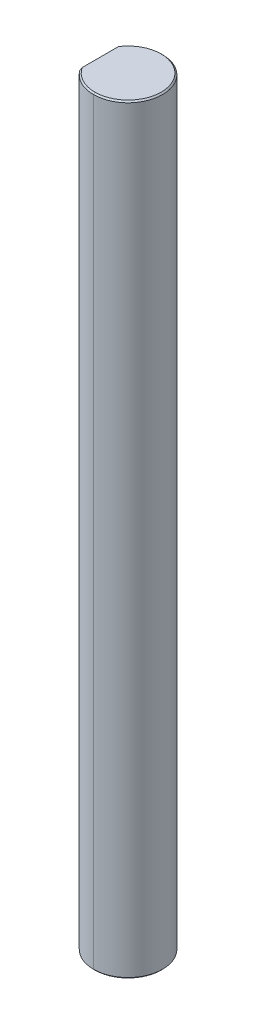
ISO-10303-21;
HEADER;
FILE_DESCRIPTION(('STEP AP214'),'2;1');
FILE_NAME('part.step','',(''),(''),'','','');
FILE_SCHEMA(('AUTOMOTIVE_DESIGN { 1 0 10303 214 1 1 1 1 }'));
ENDSEC;
DATA;
#1=APPLICATION_CONTEXT('core data for automotive mechanical design processes');
#2=APPLICATION_PROTOCOL_DEFINITION('international standard','automotive_design',2000,#1);
#3=PRODUCT_CONTEXT('',#1,'mechanical');
#4=PRODUCT('Part','Part','',(#3));
#5=PRODUCT_RELATED_PRODUCT_CATEGORY('part','',(#4));
#6=PRODUCT_DEFINITION_FORMATION('','',#4);
#7=PRODUCT_DEFINITION_CONTEXT('part definition',#1,'design');
#8=PRODUCT_DEFINITION('design','',#6,#7);
#9=PRODUCT_DEFINITION_SHAPE('','',#8);
#10=(LENGTH_UNIT() NAMED_UNIT(*) SI_UNIT(.MILLI.,.METRE.));
#11=(NAMED_UNIT(*) PLANE_ANGLE_UNIT() SI_UNIT($,.RADIAN.));
#12=(NAMED_UNIT(*) SI_UNIT($,.STERADIAN.) SOLID_ANGLE_UNIT());
#13=UNCERTAINTY_MEASURE_WITH_UNIT(LENGTH_MEASURE(1.E-05),#10,'distance_accuracy_value','');
#14=(GEOMETRIC_REPRESENTATION_CONTEXT(3) GLOBAL_UNCERTAINTY_ASSIGNED_CONTEXT((#13)) GLOBAL_UNIT_ASSIGNED_CONTEXT((#10,
#11,#12)) REPRESENTATION_CONTEXT('',''));
#15=CARTESIAN_POINT('',(0.,0.,0.));
#16=DIRECTION('',(0.,0.,1.));
#17=DIRECTION('',(1.,0.,0.));
#18=AXIS2_PLACEMENT_3D('',#15,#16,#17);
#19=CARTESIAN_POINT('',(0.,69.85,0.));
#20=DIRECTION('',(0.,-1.,0.));
#21=DIRECTION('',(0.,0.,-1.));
#22=AXIS2_PLACEMENT_3D('',#19,#20,#21);
#23=CONICAL_SURFACE('',#22,3.04419,0.785398163397457);
#24=DIRECTION('',(0.,-0.707106781186542,0.707106781186554));
#25=VECTOR('',#24,1.);
#26=CARTESIAN_POINT('',(0.,69.85,3.04419));
#27=LINE('',#26,#25);
#28=CARTESIAN_POINT('',(0.,69.85,3.04419));
#29=VERTEX_POINT('',#28);
#30=CARTESIAN_POINT('',(0.,69.723,3.17119));
#31=VERTEX_POINT('',#30);
#32=EDGE_CURVE('E97',#29,#31,#27,.T.);
#33=ORIENTED_EDGE('',*,*,#32,.F.);
#34=CARTESIAN_POINT('',(0.,69.85,0.));
#35=DIRECTION('',(0.,1.,0.));
#36=DIRECTION('',(0.,0.,1.));
#37=AXIS2_PLACEMENT_3D('',#34,#35,#36);
#38=CIRCLE('',#37,3.04419);
#39=CARTESIAN_POINT('',(-2.54381,69.85,1.67216130800831));
#40=VERTEX_POINT('',#39);
#41=EDGE_CURVE('E29',#40,#29,#38,.T.);
#42=ORIENTED_EDGE('',*,*,#41,.F.);
#43=CARTESIAN_POINT('',(-2.54381,69.723,1.89353550270387));
#44=CARTESIAN_POINT('',(-2.54381,69.7666137464441,1.82049357854221));
#45=CARTESIAN_POINT('',(-2.54381,69.809042414268,1.74672509100733));
#46=CARTESIAN_POINT('',(-2.54381,69.85,1.67216130800831));
#47=(BOUNDED_CURVE() B_SPLINE_CURVE(3,(#43,#44,#45,#46),.UNSPECIFIED.,.F.,
.F.) B_SPLINE_CURVE_WITH_KNOTS((4,4),(0.,0.00025521664145801),
.UNSPECIFIED.) CURVE() GEOMETRIC_REPRESENTATION_ITEM() RATIONAL_B_SPLINE_CURVE((1.,1.,1.,1.)) REPRESENTATION_ITEM(''));
#48=CARTESIAN_POINT('',(-2.54381,69.723,1.89353550270387));
#49=VERTEX_POINT('',#48);
#50=EDGE_CURVE('E100',#49,#40,#47,.T.);
#51=ORIENTED_EDGE('',*,*,#50,.F.);
#52=CARTESIAN_POINT('',(0.,69.723,0.));
#53=DIRECTION('',(0.,-1.,0.));
#54=DIRECTION('',(0.,0.,1.));
#55=AXIS2_PLACEMENT_3D('',#52,#53,#54);
#56=CIRCLE('',#55,3.17119);
#57=EDGE_CURVE('E94',#31,#49,#56,.T.);
#58=ORIENTED_EDGE('',*,*,#57,.F.);
#59=EDGE_LOOP('',(#33,#42,#51,#58));
#60=FACE_BOUND('',#59,.T.);
#61=ADVANCED_FACE('F16',(#60),#23,.T.);
#62=CARTESIAN_POINT('',(0.,0.127000000000016,0.));
#63=DIRECTION('',(0.,1.,0.));
#64=DIRECTION('',(0.,0.,1.));
#65=AXIS2_PLACEMENT_3D('',#62,#63,#64);
#66=CONICAL_SURFACE('',#65,3.17119,0.785398163397429);
#67=DIRECTION('',(0.,0.707106781186561,-0.707106781186534));
#68=VECTOR('',#67,1.);
#69=CARTESIAN_POINT('',(0.,0.127000000000016,-3.17119));
#70=LINE('',#69,#68);
#71=CARTESIAN_POINT('',(0.,0.,-3.04419));
#72=VERTEX_POINT('',#71);
#73=CARTESIAN_POINT('',(0.,0.127000000000016,-3.17119));
#74=VERTEX_POINT('',#73);
#75=EDGE_CURVE('E158',#72,#74,#70,.T.);
#76=ORIENTED_EDGE('',*,*,#75,.F.);
#77=CARTESIAN_POINT('',(0.,0.,0.));
#78=DIRECTION('',(0.,-1.,0.));
#79=DIRECTION('',(0.,0.,1.));
#80=AXIS2_PLACEMENT_3D('',#77,#78,#79);
#81=CIRCLE('',#80,3.04419);
#82=CARTESIAN_POINT('',(-2.54381,0.,-1.67216130800827));
#83=VERTEX_POINT('',#82);
#84=EDGE_CURVE('E11',#83,#72,#81,.T.);
#85=ORIENTED_EDGE('',*,*,#84,.F.);
#86=CARTESIAN_POINT('',(-2.54381,0.127000000000016,-1.89353550270387));
#87=CARTESIAN_POINT('',(-2.54381,0.083386253555959,-1.8204935785422));
#88=CARTESIAN_POINT('',(-2.54381,0.0409575857320611,-1.7467250910073));
#89=CARTESIAN_POINT('',(-2.54381,0.,-1.67216130800827));
#90=(BOUNDED_CURVE() B_SPLINE_CURVE(3,(#86,#87,#88,#89),.UNSPECIFIED.,.F.,
.F.) B_SPLINE_CURVE_WITH_KNOTS((4,4),(0.,0.000255216641458055),
.UNSPECIFIED.) CURVE() GEOMETRIC_REPRESENTATION_ITEM() RATIONAL_B_SPLINE_CURVE((1.,1.,1.,1.)) REPRESENTATION_ITEM(''));
#91=CARTESIAN_POINT('',(-2.54381,0.127000000000016,-1.89353550270387));
#92=VERTEX_POINT('',#91);
#93=EDGE_CURVE('E209',#92,#83,#90,.T.);
#94=ORIENTED_EDGE('',*,*,#93,.F.);
#95=CARTESIAN_POINT('',(0.,0.127000000000016,0.));
#96=DIRECTION('',(0.,1.,0.));
#97=DIRECTION('',(0.,0.,1.));
#98=AXIS2_PLACEMENT_3D('',#95,#96,#97);
#99=CIRCLE('',#98,3.17119);
#100=EDGE_CURVE('E161',#74,#92,#99,.T.);
#101=ORIENTED_EDGE('',*,*,#100,.F.);
#102=EDGE_LOOP('',(#76,#85,#94,#101));
#103=FACE_BOUND('',#102,.T.);
#104=ADVANCED_FACE('F263',(#103),#66,.T.);
#105=CARTESIAN_POINT('',(0.,0.,0.));
#106=DIRECTION('',(0.,1.,0.));
#107=DIRECTION('',(1.,0.,0.));
#108=AXIS2_PLACEMENT_3D('',#105,#106,#107);
#109=PLANE('',#108);
#110=DIRECTION('',(0.,0.,1.));
#111=VECTOR('',#110,1.);
#112=CARTESIAN_POINT('',(-2.54381,0.,-1.89353550270387));
#113=LINE('',#112,#111);
#114=CARTESIAN_POINT('',(-2.54381,0.,1.67216130800827));
#115=VERTEX_POINT('',#114);
#116=EDGE_CURVE('E151',#83,#115,#113,.T.);
#117=ORIENTED_EDGE('',*,*,#116,.F.);
#118=ORIENTED_EDGE('',*,*,#84,.T.);
#119=CARTESIAN_POINT('',(0.,0.,0.));
#120=DIRECTION('',(0.,-1.,0.));
#121=DIRECTION('',(0.,0.,1.));
#122=AXIS2_PLACEMENT_3D('',#119,#120,#121);
#123=CIRCLE('',#122,3.04419);
#124=CARTESIAN_POINT('',(0.,0.,3.04419));
#125=VERTEX_POINT('',#124);
#126=EDGE_CURVE('E152',#72,#125,#123,.T.);
#127=ORIENTED_EDGE('',*,*,#126,.T.);
#128=CARTESIAN_POINT('',(0.,0.,0.));
#129=DIRECTION('',(0.,-1.,0.));
#130=DIRECTION('',(0.,0.,1.));
#131=AXIS2_PLACEMENT_3D('',#128,#129,#130);
#132=CIRCLE('',#131,3.04419);
#133=EDGE_CURVE('E210',#125,#115,#132,.T.);
#134=ORIENTED_EDGE('',*,*,#133,.T.);
#135=EDGE_LOOP('',(#117,#118,#127,#134));
#136=FACE_BOUND('',#135,.T.);
#137=ADVANCED_FACE('F250',(#136),#109,.F.);
#138=CARTESIAN_POINT('',(0.,69.85,0.));
#139=DIRECTION('',(0.,1.,0.));
#140=DIRECTION('',(1.,0.,0.));
#141=AXIS2_PLACEMENT_3D('',#138,#139,#140);
#142=PLANE('',#141);
#143=DIRECTION('',(0.,0.,1.));
#144=VECTOR('',#143,1.);
#145=CARTESIAN_POINT('',(-2.54381,69.85,-1.89353550270387));
#146=LINE('',#145,#144);
#147=CARTESIAN_POINT('',(-2.54381,69.85,-1.67216130800831));
#148=VERTEX_POINT('',#147);
#149=EDGE_CURVE('E150',#148,#40,#146,.T.);
#150=ORIENTED_EDGE('',*,*,#149,.T.);
#151=ORIENTED_EDGE('',*,*,#41,.T.);
#152=CARTESIAN_POINT('',(0.,69.85,0.));
#153=DIRECTION('',(0.,1.,0.));
#154=DIRECTION('',(0.,0.,1.));
#155=AXIS2_PLACEMENT_3D('',#152,#153,#154);
#156=CIRCLE('',#155,3.04419);
#157=CARTESIAN_POINT('',(0.,69.85,-3.04419));
#158=VERTEX_POINT('',#157);
#159=EDGE_CURVE('E133',#29,#158,#156,.T.);
#160=ORIENTED_EDGE('',*,*,#159,.T.);
#161=CARTESIAN_POINT('',(0.,69.85,0.));
#162=DIRECTION('',(0.,1.,0.));
#163=DIRECTION('',(0.,0.,1.));
#164=AXIS2_PLACEMENT_3D('',#161,#162,#163);
#165=CIRCLE('',#164,3.04419);
#166=EDGE_CURVE('E145',#158,#148,#165,.T.);
#167=ORIENTED_EDGE('',*,*,#166,.T.);
#168=EDGE_LOOP('',(#150,#151,#160,#167));
#169=FACE_BOUND('',#168,.T.);
#170=ADVANCED_FACE('F235',(#169),#142,.T.);
#171=CARTESIAN_POINT('',(-2.54381,69.85,-1.89353550270387));
#172=DIRECTION('',(1.,0.,0.));
#173=DIRECTION('',(0.,1.,0.));
#174=AXIS2_PLACEMENT_3D('',#171,#172,#173);
#175=PLANE('',#174);
#176=DIRECTION('',(0.,-1.,0.));
#177=VECTOR('',#176,1.);
#178=CARTESIAN_POINT('',(-2.54381,69.85,-1.89353550270387));
#179=LINE('',#178,#177);
#180=CARTESIAN_POINT('',(-2.54381,69.723,-1.89353550270387));
#181=VERTEX_POINT('',#180);
#182=EDGE_CURVE('E105',#181,#92,#179,.T.);
#183=ORIENTED_EDGE('',*,*,#182,.T.);
#184=ORIENTED_EDGE('',*,*,#93,.T.);
#185=ORIENTED_EDGE('',*,*,#116,.T.);
#186=CARTESIAN_POINT('',(-2.54381,0.,1.67216130800827));
#187=CARTESIAN_POINT('',(-2.54381,0.0409575857320672,1.7467250910073));
#188=CARTESIAN_POINT('',(-2.54381,0.0833862535559554,1.8204935785422));
#189=CARTESIAN_POINT('',(-2.54381,0.127000000000016,1.89353550270387));
#190=(BOUNDED_CURVE() B_SPLINE_CURVE(3,(#186,#187,#188,#189),.UNSPECIFIED.,.F.,
.F.) B_SPLINE_CURVE_WITH_KNOTS((4,4),(0.,0.000255216641458055),
.UNSPECIFIED.) CURVE() GEOMETRIC_REPRESENTATION_ITEM() RATIONAL_B_SPLINE_CURVE((1.,1.,1.,1.)) REPRESENTATION_ITEM(''));
#191=CARTESIAN_POINT('',(-2.54381,0.127000000000016,1.89353550270387));
#192=VERTEX_POINT('',#191);
#193=EDGE_CURVE('E119',#115,#192,#190,.T.);
#194=ORIENTED_EDGE('',*,*,#193,.T.);
#195=DIRECTION('',(0.,-1.,0.));
#196=VECTOR('',#195,1.);
#197=CARTESIAN_POINT('',(-2.54381,69.85,1.89353550270387));
#198=LINE('',#197,#196);
#199=EDGE_CURVE('E104',#49,#192,#198,.T.);
#200=ORIENTED_EDGE('',*,*,#199,.F.);
#201=ORIENTED_EDGE('',*,*,#50,.T.);
#202=ORIENTED_EDGE('',*,*,#149,.F.);
#203=CARTESIAN_POINT('',(-2.54381,69.85,-1.67216130800831));
#204=CARTESIAN_POINT('',(-2.54381,69.8090424142679,-1.74672509100733));
#205=CARTESIAN_POINT('',(-2.54381,69.7666137464441,-1.82049357854221));
#206=CARTESIAN_POINT('',(-2.54381,69.723,-1.89353550270387));
#207=(BOUNDED_CURVE() B_SPLINE_CURVE(3,(#203,#204,#205,#206),.UNSPECIFIED.,.F.,
.F.) B_SPLINE_CURVE_WITH_KNOTS((4,4),(0.,0.000255216641458009),
.UNSPECIFIED.) CURVE() GEOMETRIC_REPRESENTATION_ITEM() RATIONAL_B_SPLINE_CURVE((1.,1.,1.,1.)) REPRESENTATION_ITEM(''));
#208=EDGE_CURVE('E20',#148,#181,#207,.T.);
#209=ORIENTED_EDGE('',*,*,#208,.T.);
#210=EDGE_LOOP('',(#183,#184,#185,#194,#200,#201,#202,#209));
#211=FACE_BOUND('',#210,.T.);
#212=ADVANCED_FACE('F18',(#211),#175,.F.);
#213=CARTESIAN_POINT('',(0.,69.85,0.));
#214=DIRECTION('',(0.,-1.,0.));
#215=DIRECTION('',(0.,0.,-1.));
#216=AXIS2_PLACEMENT_3D('',#213,#214,#215);
#217=CYLINDRICAL_SURFACE('',#216,3.17119);
#218=DIRECTION('',(0.,-1.,0.));
#219=VECTOR('',#218,1.);
#220=CARTESIAN_POINT('',(0.,69.85,3.17119));
#221=LINE('',#220,#219);
#222=CARTESIAN_POINT('',(0.,0.127000000000016,3.17119));
#223=VERTEX_POINT('',#222);
#224=EDGE_CURVE('E109',#31,#223,#221,.T.);
#225=ORIENTED_EDGE('',*,*,#224,.F.);
#226=ORIENTED_EDGE('',*,*,#57,.T.);
#227=ORIENTED_EDGE('',*,*,#199,.T.);
#228=CARTESIAN_POINT('',(0.,0.127000000000016,0.));
#229=DIRECTION('',(0.,1.,0.));
#230=DIRECTION('',(0.,0.,1.));
#231=AXIS2_PLACEMENT_3D('',#228,#229,#230);
#232=CIRCLE('',#231,3.17119);
#233=EDGE_CURVE('E113',#192,#223,#232,.T.);
#234=ORIENTED_EDGE('',*,*,#233,.T.);
#235=EDGE_LOOP('',(#225,#226,#227,#234));
#236=FACE_BOUND('',#235,.T.);
#237=ADVANCED_FACE('F111',(#236),#217,.T.);
#238=CARTESIAN_POINT('',(0.,69.85,0.));
#239=DIRECTION('',(0.,-1.,0.));
#240=DIRECTION('',(0.,0.,-1.));
#241=AXIS2_PLACEMENT_3D('',#238,#239,#240);
#242=CYLINDRICAL_SURFACE('',#241,3.17119);
#243=CARTESIAN_POINT('',(0.,69.723,0.));
#244=DIRECTION('',(0.,-1.,0.));
#245=DIRECTION('',(0.,0.,1.));
#246=AXIS2_PLACEMENT_3D('',#243,#244,#245);
#247=CIRCLE('',#246,3.17119);
#248=CARTESIAN_POINT('',(0.,69.723,-3.17119));
#249=VERTEX_POINT('',#248);
#250=EDGE_CURVE('E142',#181,#249,#247,.T.);
#251=ORIENTED_EDGE('',*,*,#250,.T.);
#252=DIRECTION('',(0.,-1.,0.));
#253=VECTOR('',#252,1.);
#254=CARTESIAN_POINT('',(0.,69.85,-3.17119));
#255=LINE('',#254,#253);
#256=EDGE_CURVE('E118',#249,#74,#255,.T.);
#257=ORIENTED_EDGE('',*,*,#256,.T.);
#258=ORIENTED_EDGE('',*,*,#100,.T.);
#259=ORIENTED_EDGE('',*,*,#182,.F.);
#260=EDGE_LOOP('',(#251,#257,#258,#259));
#261=FACE_BOUND('',#260,.T.);
#262=ADVANCED_FACE('F307',(#261),#242,.T.);
#263=CARTESIAN_POINT('',(0.,69.85,0.));
#264=DIRECTION('',(0.,-1.,0.));
#265=DIRECTION('',(0.,0.,-1.));
#266=AXIS2_PLACEMENT_3D('',#263,#264,#265);
#267=CYLINDRICAL_SURFACE('',#266,3.17119);
#268=CARTESIAN_POINT('',(0.,69.723,0.));
#269=DIRECTION('',(0.,-1.,0.));
#270=DIRECTION('',(0.,0.,1.));
#271=AXIS2_PLACEMENT_3D('',#268,#269,#270);
#272=CIRCLE('',#271,3.17119);
#273=EDGE_CURVE('E122',#249,#31,#272,.T.);
#274=ORIENTED_EDGE('',*,*,#273,.T.);
#275=ORIENTED_EDGE('',*,*,#224,.T.);
#276=CARTESIAN_POINT('',(0.,0.127000000000016,0.));
#277=DIRECTION('',(0.,1.,0.));
#278=DIRECTION('',(0.,0.,1.));
#279=AXIS2_PLACEMENT_3D('',#276,#277,#278);
#280=CIRCLE('',#279,3.17119);
#281=EDGE_CURVE('E182',#223,#74,#280,.T.);
#282=ORIENTED_EDGE('',*,*,#281,.T.);
#283=ORIENTED_EDGE('',*,*,#256,.F.);
#284=EDGE_LOOP('',(#274,#275,#282,#283));
#285=FACE_BOUND('',#284,.T.);
#286=ADVANCED_FACE('F123',(#285),#267,.T.);
#287=CARTESIAN_POINT('',(0.,0.127000000000016,0.));
#288=DIRECTION('',(0.,1.,0.));
#289=DIRECTION('',(0.,0.,1.));
#290=AXIS2_PLACEMENT_3D('',#287,#288,#289);
#291=CONICAL_SURFACE('',#290,3.17119,0.785398163397429);
#292=ORIENTED_EDGE('',*,*,#133,.F.);
#293=DIRECTION('',(0.,0.707106781186561,0.707106781186534));
#294=VECTOR('',#293,1.);
#295=CARTESIAN_POINT('',(0.,0.127000000000016,3.17119));
#296=LINE('',#295,#294);
#297=EDGE_CURVE('E183',#125,#223,#296,.T.);
#298=ORIENTED_EDGE('',*,*,#297,.T.);
#299=ORIENTED_EDGE('',*,*,#233,.F.);
#300=ORIENTED_EDGE('',*,*,#193,.F.);
#301=EDGE_LOOP('',(#292,#298,#299,#300));
#302=FACE_BOUND('',#301,.T.);
#303=ADVANCED_FACE('F315',(#302),#291,.T.);
#304=CARTESIAN_POINT('',(0.,0.127000000000016,0.));
#305=DIRECTION('',(0.,1.,0.));
#306=DIRECTION('',(0.,0.,1.));
#307=AXIS2_PLACEMENT_3D('',#304,#305,#306);
#308=CONICAL_SURFACE('',#307,3.17119,0.785398163397429);
#309=ORIENTED_EDGE('',*,*,#126,.F.);
#310=ORIENTED_EDGE('',*,*,#75,.T.);
#311=ORIENTED_EDGE('',*,*,#281,.F.);
#312=ORIENTED_EDGE('',*,*,#297,.F.);
#313=EDGE_LOOP('',(#309,#310,#311,#312));
#314=FACE_BOUND('',#313,.T.);
#315=ADVANCED_FACE('F295',(#314),#308,.T.);
#316=CARTESIAN_POINT('',(0.,69.85,0.));
#317=DIRECTION('',(0.,-1.,0.));
#318=DIRECTION('',(0.,0.,-1.));
#319=AXIS2_PLACEMENT_3D('',#316,#317,#318);
#320=CONICAL_SURFACE('',#319,3.04419,0.785398163397457);
#321=ORIENTED_EDGE('',*,*,#166,.F.);
#322=DIRECTION('',(0.,-0.707106781186542,-0.707106781186554));
#323=VECTOR('',#322,1.);
#324=CARTESIAN_POINT('',(0.,69.85,-3.04419));
#325=LINE('',#324,#323);
#326=EDGE_CURVE('E129',#158,#249,#325,.T.);
#327=ORIENTED_EDGE('',*,*,#326,.T.);
#328=ORIENTED_EDGE('',*,*,#250,.F.);
#329=ORIENTED_EDGE('',*,*,#208,.F.);
#330=EDGE_LOOP('',(#321,#327,#328,#329));
#331=FACE_BOUND('',#330,.T.);
#332=ADVANCED_FACE('F237',(#331),#320,.T.);
#333=CARTESIAN_POINT('',(0.,69.85,0.));
#334=DIRECTION('',(0.,-1.,0.));
#335=DIRECTION('',(0.,0.,-1.));
#336=AXIS2_PLACEMENT_3D('',#333,#334,#335);
#337=CONICAL_SURFACE('',#336,3.04419,0.785398163397457);
#338=ORIENTED_EDGE('',*,*,#159,.F.);
#339=ORIENTED_EDGE('',*,*,#32,.T.);
#340=ORIENTED_EDGE('',*,*,#273,.F.);
#341=ORIENTED_EDGE('',*,*,#326,.F.);
#342=EDGE_LOOP('',(#338,#339,#340,#341));
#343=FACE_BOUND('',#342,.T.);
#344=ADVANCED_FACE('F131',(#343),#337,.T.);
#345=CLOSED_SHELL('',(#61,#104,#137,#170,#212,#237,#262,#286,#303,#315,#332,#344));
#346=MANIFOLD_SOLID_BREP('B1',#345);
#347=ADVANCED_BREP_SHAPE_REPRESENTATION('',(#18,#346),#14);
#348=SHAPE_DEFINITION_REPRESENTATION(#9,#347);
ENDSEC;
END-ISO-10303-21;
